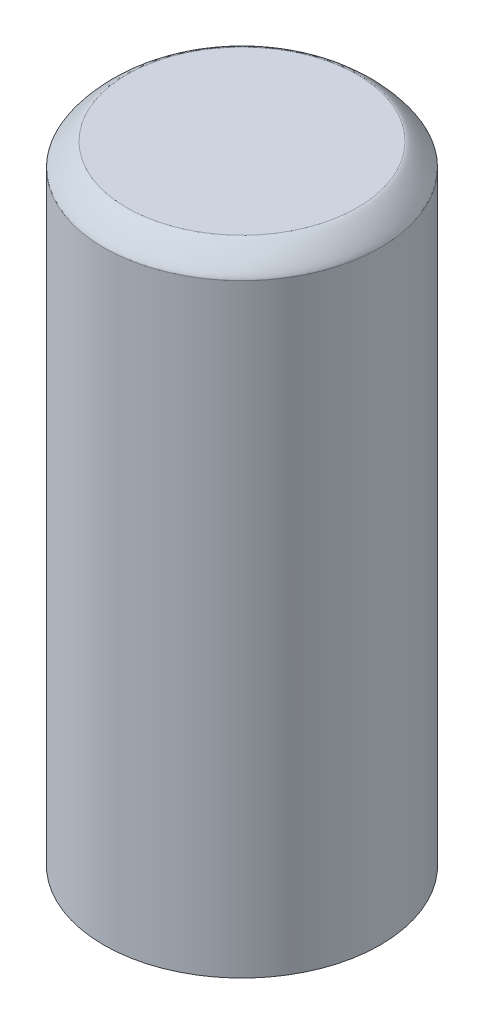
ISO-10303-21;
HEADER;
FILE_DESCRIPTION(('STEP AP214'),'2;1');
FILE_NAME('part.step','',(''),(''),'','','');
FILE_SCHEMA(('AUTOMOTIVE_DESIGN { 1 0 10303 214 1 1 1 1 }'));
ENDSEC;
DATA;
#1=APPLICATION_CONTEXT('core data for automotive mechanical design processes');
#2=APPLICATION_PROTOCOL_DEFINITION('international standard','automotive_design',2000,#1);
#3=PRODUCT_CONTEXT('',#1,'mechanical');
#4=PRODUCT('Part','Part','',(#3));
#5=PRODUCT_RELATED_PRODUCT_CATEGORY('part','',(#4));
#6=PRODUCT_DEFINITION_FORMATION('','',#4);
#7=PRODUCT_DEFINITION_CONTEXT('part definition',#1,'design');
#8=PRODUCT_DEFINITION('design','',#6,#7);
#9=PRODUCT_DEFINITION_SHAPE('','',#8);
#10=(LENGTH_UNIT() NAMED_UNIT(*) SI_UNIT(.MILLI.,.METRE.));
#11=(NAMED_UNIT(*) PLANE_ANGLE_UNIT() SI_UNIT($,.RADIAN.));
#12=(NAMED_UNIT(*) SI_UNIT($,.STERADIAN.) SOLID_ANGLE_UNIT());
#13=UNCERTAINTY_MEASURE_WITH_UNIT(LENGTH_MEASURE(1.E-05),#10,'distance_accuracy_value','');
#14=(GEOMETRIC_REPRESENTATION_CONTEXT(3) GLOBAL_UNCERTAINTY_ASSIGNED_CONTEXT((#13)) GLOBAL_UNIT_ASSIGNED_CONTEXT((#10,
#11,#12)) REPRESENTATION_CONTEXT('',''));
#15=CARTESIAN_POINT('',(0.,0.,0.));
#16=DIRECTION('',(0.,0.,1.));
#17=DIRECTION('',(1.,0.,0.));
#18=AXIS2_PLACEMENT_3D('',#15,#16,#17);
#19=CARTESIAN_POINT('',(0.,13.6,0.));
#20=DIRECTION('',(0.,-1.,0.));
#21=DIRECTION('',(0.,0.,-1.));
#22=AXIS2_PLACEMENT_3D('',#19,#20,#21);
#23=CYLINDRICAL_SURFACE('',#22,3.);
#24=CARTESIAN_POINT('',(0.,13.1,3.));
#25=CARTESIAN_POINT('',(0.392699071226847,13.1,3.));
#26=CARTESIAN_POINT('',(0.78524366275268,13.1,2.9219180259975));
#27=CARTESIAN_POINT('',(1.51085693143786,13.1,2.62135916907022));
#28=CARTESIAN_POINT('',(1.84364016732954,13.1,2.39900051978975));
#29=CARTESIAN_POINT('',(2.39900051978975,13.1,1.84364016732954));
#30=CARTESIAN_POINT('',(2.62135916907022,13.1,1.51085693143788));
#31=CARTESIAN_POINT('',(2.92191802599751,13.1,0.785243662752659));
#32=CARTESIAN_POINT('',(3.,13.1,0.392699071226749));
#33=CARTESIAN_POINT('',(3.,13.1,-0.392699071226749));
#34=CARTESIAN_POINT('',(2.92191802599749,13.1,-0.785243662752691));
#35=CARTESIAN_POINT('',(2.62135916907023,13.1,-1.51085693143785));
#36=CARTESIAN_POINT('',(2.39900051978978,13.1,-1.84364016732951));
#37=CARTESIAN_POINT('',(1.8436401673295,13.1,-2.39900051978978));
#38=CARTESIAN_POINT('',(1.51085693143785,13.1,-2.62135916907023));
#39=CARTESIAN_POINT('',(0.785243662752694,13.1,-2.92191802599749));
#40=CARTESIAN_POINT('',(0.392699071226749,13.1,-3.));
#41=CARTESIAN_POINT('',(-0.392699071226748,13.1,-3.));
#42=CARTESIAN_POINT('',(-0.785243662752686,13.1,-2.9219180259975));
#43=CARTESIAN_POINT('',(-1.51085693143785,13.1,-2.62135916907023));
#44=CARTESIAN_POINT('',(-1.84364016732954,13.1,-2.39900051978974));
#45=CARTESIAN_POINT('',(-2.39900051978975,13.1,-1.84364016732954));
#46=CARTESIAN_POINT('',(-2.62135916907021,13.1,-1.51085693143788));
#47=CARTESIAN_POINT('',(-2.92191802599751,13.1,-0.785243662752664));
#48=CARTESIAN_POINT('',(-3.,13.1,-0.392699071226745));
#49=CARTESIAN_POINT('',(-3.,13.1,0.392699071226754));
#50=CARTESIAN_POINT('',(-2.9219180259975,13.1,0.785243662752685));
#51=CARTESIAN_POINT('',(-2.62135916907023,13.1,1.51085693143784));
#52=CARTESIAN_POINT('',(-2.39900051978975,13.1,1.84364016732953));
#53=CARTESIAN_POINT('',(-1.84364016732955,13.1,2.39900051978974));
#54=CARTESIAN_POINT('',(-1.51085693143785,13.1,2.62135916907023));
#55=CARTESIAN_POINT('',(-0.785243662752694,13.1,2.92191802599749));
#56=CARTESIAN_POINT('',(-0.392699071226848,13.1,3.));
#57=CARTESIAN_POINT('',(0.,13.1,3.));
#58=(BOUNDED_CURVE() B_SPLINE_CURVE(3,(#24,#25,#26,#27,#28,#29,#30,#31,#32,#33,#34,#35,#36,#37,
#38,#39,#40,#41,#42,#43,#44,#45,#46,#47,#48,#49,#50,#51,#52,#53,#54,#55,#56,#57),.UNSPECIFIED.,
.T.,.F.) B_SPLINE_CURVE_WITH_KNOTS((4,2,2,2,2,2,2,2,2,2,2,2,2,2,2,2,4),(0.,0.392699081698724,
0.785398163397448,1.17809724509617,1.5707963267949,1.96349540849362,2.35619449019234,
2.74889357189107,3.14159265358979,3.53429173528852,3.92699081698724,4.31968989868597,
4.71238898038469,5.10508806208341,5.49778714378214,5.89048622548086,6.28318530717959),
.UNSPECIFIED.) CURVE() GEOMETRIC_REPRESENTATION_ITEM() RATIONAL_B_SPLINE_CURVE((0.999999999999963,
0.999999999999963,0.999999999999963,0.999999999999963,0.999999999999963,0.999999999999963,
0.999999999999963,0.999999999999963,0.999999999999963,0.999999999999963,0.999999999999963,
0.999999999999963,0.999999999999963,0.999999999999963,0.999999999999963,0.999999999999963,
0.999999999999963,0.999999999999963,0.999999999999963,0.999999999999963,0.999999999999963,
0.999999999999963,0.999999999999963,0.999999999999963,0.999999999999963,0.999999999999963,
0.999999999999963,0.999999999999963,0.999999999999963,0.999999999999963,0.999999999999963,
0.999999999999963,0.999999999999963,0.999999999999963)) REPRESENTATION_ITEM(''));
#59=CARTESIAN_POINT('',(0.,13.1,3.));
#60=VERTEX_POINT('',#59);
#61=EDGE_CURVE('E11',#60,#60,#58,.F.);
#62=ORIENTED_EDGE('',*,*,#61,.T.);
#63=EDGE_LOOP('',(#62));
#64=FACE_BOUND('',#63,.T.);
#65=CARTESIAN_POINT('',(0.,0.,0.));
#66=DIRECTION('',(0.,1.,0.));
#67=DIRECTION('',(0.,0.,1.));
#68=AXIS2_PLACEMENT_3D('',#65,#66,#67);
#69=CIRCLE('',#68,3.);
#70=CARTESIAN_POINT('',(0.,0.,3.));
#71=VERTEX_POINT('',#70);
#72=EDGE_CURVE('E51',#71,#71,#69,.T.);
#73=ORIENTED_EDGE('',*,*,#72,.T.);
#74=EDGE_LOOP('',(#73));
#75=FACE_BOUND('',#74,.T.);
#76=ADVANCED_FACE('F34',(#64,#75),#23,.T.);
#77=CARTESIAN_POINT('',(0.,13.6,0.));
#78=DIRECTION('',(0.,1.,0.));
#79=DIRECTION('',(0.,0.,1.));
#80=AXIS2_PLACEMENT_3D('',#77,#78,#79);
#81=PLANE('',#80);
#82=CARTESIAN_POINT('',(0.,13.6,2.5));
#83=CARTESIAN_POINT('',(-0.0409052481509312,13.6,2.50000006617747));
#84=CARTESIAN_POINT('',(-0.0818096781630555,13.6,2.49898335698272));
#85=CARTESIAN_POINT('',(-0.163518212495015,13.6,2.49493567681808));
#86=CARTESIAN_POINT('',(-0.204322318424316,13.6,2.49190473837622));
#87=CARTESIAN_POINT('',(-0.285733577358172,13.6,2.4838478147328));
#88=CARTESIAN_POINT('',(-0.326340726794507,13.6,2.47882179352238));
#89=CARTESIAN_POINT('',(-0.407262017777786,13.6,2.46679390634881));
#90=CARTESIAN_POINT('',(-0.447576154134936,13.6,2.45979200547631));
#91=CARTESIAN_POINT('',(-0.527815199830451,13.6,2.44383146859168));
#92=CARTESIAN_POINT('',(-0.567740109168817,13.6,2.43487283257957));
#93=CARTESIAN_POINT('',(-0.6471045213121,13.6,2.41501790448334));
#94=CARTESIAN_POINT('',(-0.686544032680984,13.6,2.40412164663759));
#95=CARTESIAN_POINT('',(-0.764841421042821,13.6,2.38041056826906));
#96=CARTESIAN_POINT('',(-0.803699308521022,13.6,2.36759578237855));
#97=CARTESIAN_POINT('',(-0.88073735135589,13.6,2.34006671921941));
#98=CARTESIAN_POINT('',(-0.918917495757736,13.6,2.32535241127925));
#99=CARTESIAN_POINT('',(-0.994499666067721,13.6,2.29404525127718));
#100=CARTESIAN_POINT('',(-1.03190169197586,13.6,2.27745239921526));
#101=CARTESIAN_POINT('',(-1.10584180176352,13.6,2.24244426388046));
#102=CARTESIAN_POINT('',(-1.14237989958485,13.6,2.22402901004185));
#103=CARTESIAN_POINT('',(-1.21451077793755,13.6,2.18543066036773));
#104=CARTESIAN_POINT('',(-1.2501035413944,13.6,2.16524753262934));
#105=CARTESIAN_POINT('',(-1.32026221049554,13.6,2.12316797186274));
#106=CARTESIAN_POINT('',(-1.35482809798532,13.6,2.10127150856868));
#107=CARTESIAN_POINT('',(-1.4228514722141,13.6,2.05581974302993));
#108=CARTESIAN_POINT('',(-1.4563089589531,13.6,2.03226444078523));
#109=CARTESIAN_POINT('',(-1.52203396418431,13.6,1.98354943312055));
#110=CARTESIAN_POINT('',(-1.55430150369108,13.6,1.9583897560554));
#111=CARTESIAN_POINT('',(-1.61756502105077,13.6,1.90652046282195));
#112=CARTESIAN_POINT('',(-1.648561021844,13.6,1.87981087463717));
#113=CARTESIAN_POINT('',(-1.70919997655589,13.6,1.82489615395677));
#114=CARTESIAN_POINT('',(-1.73884290861615,13.6,1.79669099731658));
#115=CARTESIAN_POINT('',(-1.79669099731659,13.6,1.73884290861614));
#116=CARTESIAN_POINT('',(-1.82489615395678,13.6,1.70919997655589));
#117=CARTESIAN_POINT('',(-1.87981087463718,13.6,1.64856102184399));
#118=CARTESIAN_POINT('',(-1.90652046282196,13.6,1.61756502105076));
#119=CARTESIAN_POINT('',(-1.95838975605541,13.6,1.55430150369107));
#120=CARTESIAN_POINT('',(-1.98354943312056,13.6,1.52203396418431));
#121=CARTESIAN_POINT('',(-2.03226444078523,13.6,1.45630895895308));
#122=CARTESIAN_POINT('',(-2.05581974302992,13.6,1.42285147221402));
#123=CARTESIAN_POINT('',(-2.1012715085687,13.6,1.35482809798537));
#124=CARTESIAN_POINT('',(-2.12316797186278,13.6,1.32026221049577));
#125=CARTESIAN_POINT('',(-2.16524753262931,13.6,1.25010354139415));
#126=CARTESIAN_POINT('',(-2.18543066036761,13.6,1.21451077793664));
#127=CARTESIAN_POINT('',(-2.22402901004198,13.6,1.14237989958574));
#128=CARTESIAN_POINT('',(-2.24244426388093,13.6,1.10584180176687));
#129=CARTESIAN_POINT('',(-2.27745239921479,13.6,1.03190169197249));
#130=CARTESIAN_POINT('',(-2.29404525127542,13.6,0.994499666055162));
#131=CARTESIAN_POINT('',(-2.32535241128101,13.6,0.918917495770279));
#132=CARTESIAN_POINT('',(-2.34006671922597,13.6,0.880737351402722));
#133=CARTESIAN_POINT('',(-2.36759578237199,13.6,0.803699308474169));
#134=CARTESIAN_POINT('',(-2.38041056824457,13.6,0.764841420867995));
#135=CARTESIAN_POINT('',(-2.40412164666209,13.6,0.686544032855779));
#136=CARTESIAN_POINT('',(-2.41501790457475,13.6,0.6471045219645));
#137=CARTESIAN_POINT('',(-2.43487283248817,13.6,0.567740108516354));
#138=CARTESIAN_POINT('',(-2.44383146825055,13.6,0.52781519739548));
#139=CARTESIAN_POINT('',(-2.45979200581745,13.6,0.447576156569843));
#140=CARTESIAN_POINT('',(-2.46679390762197,13.6,0.40726202686508));
#141=CARTESIAN_POINT('',(-2.47882179224925,13.6,0.326340717707305));
#142=CARTESIAN_POINT('',(-2.48384780998145,13.6,0.285733543444643));
#143=CARTESIAN_POINT('',(-2.49190474312748,13.6,0.204322352337171));
#144=CARTESIAN_POINT('',(-2.49493569454987,13.6,0.16351833905846));
#145=CARTESIAN_POINT('',(-2.49898333925064,13.6,0.0818095515975307));
#146=CARTESIAN_POINT('',(-2.5,13.6,0.0409047757987673));
#147=CARTESIAN_POINT('',(-2.5,13.6,-0.0409047757987597));
#148=CARTESIAN_POINT('',(-2.49898333925064,13.6,-0.0818095515975234));
#149=CARTESIAN_POINT('',(-2.49493569454987,13.6,-0.163518339058453));
#150=CARTESIAN_POINT('',(-2.49190474312748,13.6,-0.204322352337164));
#151=CARTESIAN_POINT('',(-2.48384780998145,13.6,-0.285733543444639));
#152=CARTESIAN_POINT('',(-2.47882179224925,13.6,-0.326340717707301));
#153=CARTESIAN_POINT('',(-2.46679390762197,13.6,-0.407262026865078));
#154=CARTESIAN_POINT('',(-2.45979200581745,13.6,-0.447576156569842));
#155=CARTESIAN_POINT('',(-2.44383146825054,13.6,-0.527815197395481));
#156=CARTESIAN_POINT('',(-2.43487283248817,13.6,-0.567740108516356));
#157=CARTESIAN_POINT('',(-2.41501790457475,13.6,-0.647104521964503));
#158=CARTESIAN_POINT('',(-2.40412164666208,13.6,-0.686544032855783));
#159=CARTESIAN_POINT('',(-2.38041056824457,13.6,-0.764841420868));
#160=CARTESIAN_POINT('',(-2.36759578237199,13.6,-0.803699308474175));
#161=CARTESIAN_POINT('',(-2.34006671922597,13.6,-0.880737351402729));
#162=CARTESIAN_POINT('',(-2.32535241128101,13.6,-0.918917495770286));
#163=CARTESIAN_POINT('',(-2.29404525127542,13.6,-0.994499666055169));
#164=CARTESIAN_POINT('',(-2.27745239921478,13.6,-1.0319016919725));
#165=CARTESIAN_POINT('',(-2.24244426388093,13.6,-1.10584180176688));
#166=CARTESIAN_POINT('',(-2.22402901004197,13.6,-1.14237989958575));
#167=CARTESIAN_POINT('',(-2.18543066036761,13.6,-1.21451077793665));
#168=CARTESIAN_POINT('',(-2.16524753262931,13.6,-1.25010354139416));
#169=CARTESIAN_POINT('',(-2.12316797186278,13.6,-1.32026221049579));
#170=CARTESIAN_POINT('',(-2.1012715085687,13.6,-1.35482809798539));
#171=CARTESIAN_POINT('',(-2.05581974302992,13.6,-1.42285147221404));
#172=CARTESIAN_POINT('',(-2.03226444078523,13.6,-1.4563089589531));
#173=CARTESIAN_POINT('',(-1.98354943312055,13.6,-1.52203396418433));
#174=CARTESIAN_POINT('',(-1.95838975605541,13.6,-1.55430150369109));
#175=CARTESIAN_POINT('',(-1.90652046282196,13.6,-1.61756502105078));
#176=CARTESIAN_POINT('',(-1.87981087463718,13.6,-1.648561021844));
#177=CARTESIAN_POINT('',(-1.82489615395677,13.6,-1.7091999765559));
#178=CARTESIAN_POINT('',(-1.79669099731659,13.6,-1.73884290861615));
#179=CARTESIAN_POINT('',(-1.73884290861615,13.6,-1.79669099731658));
#180=CARTESIAN_POINT('',(-1.70919997655589,13.6,-1.82489615395676));
#181=CARTESIAN_POINT('',(-1.64856102184399,13.6,-1.87981087463717));
#182=CARTESIAN_POINT('',(-1.61756502105076,13.6,-1.90652046282194));
#183=CARTESIAN_POINT('',(-1.55430150369107,13.6,-1.95838975605539));
#184=CARTESIAN_POINT('',(-1.52203396418432,13.6,-1.98354943312054));
#185=CARTESIAN_POINT('',(-1.45630895895308,13.6,-2.03226444078521));
#186=CARTESIAN_POINT('',(-1.42285147221403,13.6,-2.05581974302991));
#187=CARTESIAN_POINT('',(-1.35482809798538,13.6,-2.10127150856868));
#188=CARTESIAN_POINT('',(-1.32026221049578,13.6,-2.12316797186277));
#189=CARTESIAN_POINT('',(-1.25010354139415,13.6,-2.1652475326293));
#190=CARTESIAN_POINT('',(-1.21451077793664,13.6,-2.1854306603676));
#191=CARTESIAN_POINT('',(-1.14237989958574,13.6,-2.22402901004197));
#192=CARTESIAN_POINT('',(-1.10584180176687,13.6,-2.24244426388093));
#193=CARTESIAN_POINT('',(-1.03190169197249,13.6,-2.27745239921479));
#194=CARTESIAN_POINT('',(-0.994499666055162,13.6,-2.29404525127542));
#195=CARTESIAN_POINT('',(-0.91891749577028,13.6,-2.32535241128101));
#196=CARTESIAN_POINT('',(-0.880737351402724,13.6,-2.34006671922597));
#197=CARTESIAN_POINT('',(-0.80369930847417,13.6,-2.36759578237199));
#198=CARTESIAN_POINT('',(-0.764841420867996,13.6,-2.38041056824457));
#199=CARTESIAN_POINT('',(-0.686544032855779,13.6,-2.40412164666209));
#200=CARTESIAN_POINT('',(-0.6471045219645,13.6,-2.41501790457475));
#201=CARTESIAN_POINT('',(-0.567740108516353,13.6,-2.43487283248817));
#202=CARTESIAN_POINT('',(-0.527815197395479,13.6,-2.44383146825055));
#203=CARTESIAN_POINT('',(-0.447576156569841,13.6,-2.45979200581745));
#204=CARTESIAN_POINT('',(-0.407262026865077,13.6,-2.46679390762197));
#205=CARTESIAN_POINT('',(-0.326340717707302,13.6,-2.47882179224925));
#206=CARTESIAN_POINT('',(-0.285733543444641,13.6,-2.48384780998145));
#207=CARTESIAN_POINT('',(-0.204322352337168,13.6,-2.49190474312748));
#208=CARTESIAN_POINT('',(-0.163518339058456,13.6,-2.49493569454987));
#209=CARTESIAN_POINT('',(-0.0818095515975266,13.6,-2.49898333925064));
#210=CARTESIAN_POINT('',(-0.0409047757987632,13.6,-2.5));
#211=CARTESIAN_POINT('',(0.0409047757987639,13.6,-2.5));
#212=CARTESIAN_POINT('',(0.0818095515975275,13.6,-2.49898333925064));
#213=CARTESIAN_POINT('',(0.163518339058458,13.6,-2.49493569454987));
#214=CARTESIAN_POINT('',(0.204322352337169,13.6,-2.49190474312748));
#215=CARTESIAN_POINT('',(0.285733543444643,13.6,-2.48384780998145));
#216=CARTESIAN_POINT('',(0.326340717707304,13.6,-2.47882179224925));
#217=CARTESIAN_POINT('',(0.40726202686508,13.6,-2.46679390762197));
#218=CARTESIAN_POINT('',(0.447576156569844,13.6,-2.45979200581744));
#219=CARTESIAN_POINT('',(0.527815197395483,13.6,-2.44383146825054));
#220=CARTESIAN_POINT('',(0.567740108516358,13.6,-2.43487283248816));
#221=CARTESIAN_POINT('',(0.647104521964505,13.6,-2.41501790457475));
#222=CARTESIAN_POINT('',(0.686544032855785,13.6,-2.40412164666208));
#223=CARTESIAN_POINT('',(0.764841420868002,13.6,-2.38041056824457));
#224=CARTESIAN_POINT('',(0.803699308474177,13.6,-2.36759578237199));
#225=CARTESIAN_POINT('',(0.88073735140273,13.6,-2.34006671922597));
#226=CARTESIAN_POINT('',(0.918917495770287,13.6,-2.32535241128101));
#227=CARTESIAN_POINT('',(0.994499666055168,13.6,-2.29404525127542));
#228=CARTESIAN_POINT('',(1.03190169197249,13.6,-2.27745239921479));
#229=CARTESIAN_POINT('',(1.10584180176688,13.6,-2.24244426388093));
#230=CARTESIAN_POINT('',(1.14237989958574,13.6,-2.22402901004197));
#231=CARTESIAN_POINT('',(1.21451077793664,13.6,-2.18543066036761));
#232=CARTESIAN_POINT('',(1.25010354139415,13.6,-2.16524753262931));
#233=CARTESIAN_POINT('',(1.32026221049577,13.6,-2.12316797186278));
#234=CARTESIAN_POINT('',(1.35482809798537,13.6,-2.1012715085687));
#235=CARTESIAN_POINT('',(1.42285147221402,13.6,-2.05581974302992));
#236=CARTESIAN_POINT('',(1.45630895895307,13.6,-2.03226444078523));
#237=CARTESIAN_POINT('',(1.5220339641843,13.6,-1.98354943312055));
#238=CARTESIAN_POINT('',(1.55430150369106,13.6,-1.95838975605541));
#239=CARTESIAN_POINT('',(1.61756502105075,13.6,-1.90652046282196));
#240=CARTESIAN_POINT('',(1.64856102184398,13.6,-1.87981087463718));
#241=CARTESIAN_POINT('',(1.70919997655588,13.6,-1.82489615395677));
#242=CARTESIAN_POINT('',(1.73884290861614,13.6,-1.79669099731659));
#243=CARTESIAN_POINT('',(1.79669099731659,13.6,-1.73884290861615));
#244=CARTESIAN_POINT('',(1.82489615395678,13.6,-1.70919997655589));
#245=CARTESIAN_POINT('',(1.87981087463719,13.6,-1.64856102184399));
#246=CARTESIAN_POINT('',(1.90652046282197,13.6,-1.61756502105076));
#247=CARTESIAN_POINT('',(1.95838975605542,13.6,-1.55430150369107));
#248=CARTESIAN_POINT('',(1.98354943312057,13.6,-1.52203396418432));
#249=CARTESIAN_POINT('',(2.03226444078524,13.6,-1.45630895895308));
#250=CARTESIAN_POINT('',(2.05581974302993,13.6,-1.42285147221402));
#251=CARTESIAN_POINT('',(2.10127150856871,13.6,-1.35482809798537));
#252=CARTESIAN_POINT('',(2.12316797186279,13.6,-1.32026221049577));
#253=CARTESIAN_POINT('',(2.16524753262931,13.6,-1.25010354139414));
#254=CARTESIAN_POINT('',(2.18543066036762,13.6,-1.21451077793664));
#255=CARTESIAN_POINT('',(2.22402901004198,13.6,-1.14237989958574));
#256=CARTESIAN_POINT('',(2.24244426388093,13.6,-1.10584180176687));
#257=CARTESIAN_POINT('',(2.27745239921479,13.6,-1.03190169197249));
#258=CARTESIAN_POINT('',(2.29404525127542,13.6,-0.994499666055165));
#259=CARTESIAN_POINT('',(2.32535241128101,13.6,-0.918917495770286));
#260=CARTESIAN_POINT('',(2.34006671922597,13.6,-0.880737351402731));
#261=CARTESIAN_POINT('',(2.36759578237199,13.6,-0.80369930847418));
#262=CARTESIAN_POINT('',(2.38041056824457,13.6,-0.764841420868006));
#263=CARTESIAN_POINT('',(2.40412164666208,13.6,-0.68654403285579));
#264=CARTESIAN_POINT('',(2.41501790457475,13.6,-0.647104521964511));
#265=CARTESIAN_POINT('',(2.43487283248817,13.6,-0.567740108516363));
#266=CARTESIAN_POINT('',(2.44383146825055,13.6,-0.527815197395488));
#267=CARTESIAN_POINT('',(2.45979200581745,13.6,-0.447576156569849));
#268=CARTESIAN_POINT('',(2.46679390762197,13.6,-0.407262026865084));
#269=CARTESIAN_POINT('',(2.47882179224925,13.6,-0.326340717707307));
#270=CARTESIAN_POINT('',(2.48384780998145,13.6,-0.285733543444645));
#271=CARTESIAN_POINT('',(2.49190474312748,13.6,-0.20432235233717));
#272=CARTESIAN_POINT('',(2.49493569454987,13.6,-0.163518339058459));
#273=CARTESIAN_POINT('',(2.49898333925064,13.6,-0.0818095515975278));
#274=CARTESIAN_POINT('',(2.5,13.6,-0.0409047757987638));
#275=CARTESIAN_POINT('',(2.5,13.6,0.0409047757987639));
#276=CARTESIAN_POINT('',(2.49898333925064,13.6,0.0818095515975275));
#277=CARTESIAN_POINT('',(2.49493569454987,13.6,0.163518339058457));
#278=CARTESIAN_POINT('',(2.49190474312748,13.6,0.204322352337169));
#279=CARTESIAN_POINT('',(2.48384780998145,13.6,0.285733543444642));
#280=CARTESIAN_POINT('',(2.47882179224925,13.6,0.326340717707303));
#281=CARTESIAN_POINT('',(2.46679390762197,13.6,0.407262026865078));
#282=CARTESIAN_POINT('',(2.45979200581745,13.6,0.447576156569842));
#283=CARTESIAN_POINT('',(2.44383146825055,13.6,0.52781519739548));
#284=CARTESIAN_POINT('',(2.43487283248817,13.6,0.567740108516355));
#285=CARTESIAN_POINT('',(2.41501790457475,13.6,0.647104521964502));
#286=CARTESIAN_POINT('',(2.40412164666209,13.6,0.686544032855781));
#287=CARTESIAN_POINT('',(2.38041056824457,13.6,0.764841420867998));
#288=CARTESIAN_POINT('',(2.36759578237199,13.6,0.803699308474173));
#289=CARTESIAN_POINT('',(2.34006671922597,13.6,0.880737351402726));
#290=CARTESIAN_POINT('',(2.32535241128101,13.6,0.918917495770282));
#291=CARTESIAN_POINT('',(2.29404525127542,13.6,0.994499666055165));
#292=CARTESIAN_POINT('',(2.27745239921479,13.6,1.03190169197249));
#293=CARTESIAN_POINT('',(2.24244426388093,13.6,1.10584180176688));
#294=CARTESIAN_POINT('',(2.22402901004197,13.6,1.14237989958574));
#295=CARTESIAN_POINT('',(2.18543066036761,13.6,1.21451077793665));
#296=CARTESIAN_POINT('',(2.16524753262931,13.6,1.25010354139415));
#297=CARTESIAN_POINT('',(2.12316797186278,13.6,1.32026221049578));
#298=CARTESIAN_POINT('',(2.1012715085687,13.6,1.35482809798538));
#299=CARTESIAN_POINT('',(2.05581974302992,13.6,1.42285147221403));
#300=CARTESIAN_POINT('',(2.03226444078523,13.6,1.45630895895308));
#301=CARTESIAN_POINT('',(1.98354943312055,13.6,1.52203396418432));
#302=CARTESIAN_POINT('',(1.95838975605541,13.6,1.55430150369107));
#303=CARTESIAN_POINT('',(1.90652046282196,13.6,1.61756502105076));
#304=CARTESIAN_POINT('',(1.87981087463718,13.6,1.64856102184399));
#305=CARTESIAN_POINT('',(1.82489615395677,13.6,1.70919997655589));
#306=CARTESIAN_POINT('',(1.79669099731659,13.6,1.73884290861615));
#307=CARTESIAN_POINT('',(1.73884290861615,13.6,1.79669099731659));
#308=CARTESIAN_POINT('',(1.70919997655589,13.6,1.82489615395677));
#309=CARTESIAN_POINT('',(1.64856102184399,13.6,1.87981087463718));
#310=CARTESIAN_POINT('',(1.61756502105077,13.6,1.90652046282196));
#311=CARTESIAN_POINT('',(1.55430150369107,13.6,1.95838975605541));
#312=CARTESIAN_POINT('',(1.5220339641843,13.6,1.98354943312055));
#313=CARTESIAN_POINT('',(1.4563089589531,13.6,2.03226444078524));
#314=CARTESIAN_POINT('',(1.42285147221409,13.6,2.05581974302994));
#315=CARTESIAN_POINT('',(1.35482809798531,13.6,2.10127150856869));
#316=CARTESIAN_POINT('',(1.32026221049553,13.6,2.12316797186275));
#317=CARTESIAN_POINT('',(1.25010354139439,13.6,2.16524753262935));
#318=CARTESIAN_POINT('',(1.21451077793754,13.6,2.18543066036774));
#319=CARTESIAN_POINT('',(1.14237989958484,13.6,2.22402901004185));
#320=CARTESIAN_POINT('',(1.10584180176351,13.6,2.24244426388046));
#321=CARTESIAN_POINT('',(1.03190169197585,13.6,2.27745239921526));
#322=CARTESIAN_POINT('',(0.994499666067716,13.6,2.29404525127718));
#323=CARTESIAN_POINT('',(0.918917495757734,13.6,2.32535241127925));
#324=CARTESIAN_POINT('',(0.880737351355888,13.6,2.3400667192194));
#325=CARTESIAN_POINT('',(0.803699308521023,13.6,2.36759578237855));
#326=CARTESIAN_POINT('',(0.764841421042822,13.6,2.38041056826906));
#327=CARTESIAN_POINT('',(0.686544032680985,13.6,2.40412164663759));
#328=CARTESIAN_POINT('',(0.6471045213121,13.6,2.41501790448333));
#329=CARTESIAN_POINT('',(0.567740109168817,13.6,2.43487283257957));
#330=CARTESIAN_POINT('',(0.527815199830452,13.6,2.44383146859168));
#331=CARTESIAN_POINT('',(0.447576154134936,13.6,2.4597920054763));
#332=CARTESIAN_POINT('',(0.407262017777786,13.6,2.46679390634881));
#333=CARTESIAN_POINT('',(0.326340726794508,13.6,2.47882179352238));
#334=CARTESIAN_POINT('',(0.285733577358173,13.6,2.4838478147328));
#335=CARTESIAN_POINT('',(0.204322318424317,13.6,2.49190473837622));
#336=CARTESIAN_POINT('',(0.163518212495016,13.6,2.49493567681808));
#337=CARTESIAN_POINT('',(0.0818096781630558,13.6,2.49898335698272));
#338=CARTESIAN_POINT('',(0.0409052481509313,13.6,2.50000006617747));
#339=CARTESIAN_POINT('',(0.,13.6,2.5));
#340=B_SPLINE_CURVE_WITH_KNOTS('',3,(#82,#83,#84,#85,#86,#87,#88,#89,#90,#91,#92,#93,#94,#95,
#96,#97,#98,#99,#100,#101,#102,#103,#104,#105,#106,#107,#108,#109,#110,#111,#112,#113,#114,#115,
#116,#117,#118,#119,#120,#121,#122,#123,#124,#125,#126,#127,#128,#129,#130,#131,#132,#133,#134,
#135,#136,#137,#138,#139,#140,#141,#142,#143,#144,#145,#146,#147,#148,#149,#150,#151,#152,#153,
#154,#155,#156,#157,#158,#159,#160,#161,#162,#163,#164,#165,#166,#167,#168,#169,#170,#171,#172,
#173,#174,#175,#176,#177,#178,#179,#180,#181,#182,#183,#184,#185,#186,#187,#188,#189,#190,#191,
#192,#193,#194,#195,#196,#197,#198,#199,#200,#201,#202,#203,#204,#205,#206,#207,#208,#209,#210,
#211,#212,#213,#214,#215,#216,#217,#218,#219,#220,#221,#222,#223,#224,#225,#226,#227,#228,#229,
#230,#231,#232,#233,#234,#235,#236,#237,#238,#239,#240,#241,#242,#243,#244,#245,#246,#247,#248,
#249,#250,#251,#252,#253,#254,#255,#256,#257,#258,#259,#260,#261,#262,#263,#264,#265,#266,#267,
#268,#269,#270,#271,#272,#273,#274,#275,#276,#277,#278,#279,#280,#281,#282,#283,#284,#285,#286,
#287,#288,#289,#290,#291,#292,#293,#294,#295,#296,#297,#298,#299,#300,#301,#302,#303,#304,#305,
#306,#307,#308,#309,#310,#311,#312,#313,#314,#315,#316,#317,#318,#319,#320,#321,#322,#323,#324,
#325,#326,#327,#328,#329,#330,#331,#332,#333,#334,#335,#336,#337,#338,#339),.UNSPECIFIED.,.F.,
.F.,(4,2,2,2,2,2,2,2,2,2,2,2,2,2,2,2,2,2,2,2,2,2,2,2,2,2,2,2,2,2,2,2,2,2,2,2,2,2,2,2,2,2,2,2,2,
2,2,2,2,2,2,2,2,2,2,2,2,2,2,2,2,2,2,2,2,2,2,2,2,2,2,2,2,2,2,2,2,2,2,2,2,2,2,2,2,2,2,2,2,2,2,2,2,
2,2,2,2,2,2,2,2,2,2,2,2,2,2,2,2,2,2,2,2,2,2,2,2,2,2,2,2,2,2,2,2,2,2,2,4),(0.,0.12270195209587,
0.245401922711705,0.368104108016641,0.490808461329764,0.613512814642883,0.736214999947807,
0.858914970563624,0.981616922659472,1.10431887475532,1.22701884537115,1.34972103067608,
1.47242538398921,1.59512973730234,1.71783192260727,1.8405318932231,1.96323384531894,
2.08593579741479,2.20863576803061,2.33133795333554,2.45404230664867,2.5767466599618,
2.69944884526673,2.82214881588256,2.94485076797841,3.06755272007425,3.19025269069008,
3.31295487599501,3.43565922930814,3.55836358262126,3.6810657679262,3.80376573854202,
3.92646769063786,4.04916964273371,4.17186961334953,4.29457179865447,4.4172761519676,
4.53998050528073,4.66268269058566,4.78538266120149,4.90808461329734,5.03078656539319,
5.15348653600902,5.27618872131395,5.39889307462708,5.52159742794021,5.64429961324514,
5.76699958386096,5.8897015359568,6.01240348805264,6.13510345866846,6.25780564397339,
6.38050999728652,6.50321435059965,6.62591653590459,6.74861650652042,6.87131845861627,
6.99402041071212,7.11672038132794,7.23942256663288,7.362126919946,7.48483127325913,
7.60753345856406,7.73023342917989,7.85293538127573,7.97563733337158,8.0983373039874,
8.22103948929234,8.34374384260547,8.46644819591859,8.58915038122353,8.71185035183935,
8.8345523039352,8.95725425603105,9.07995422664687,9.2026564119518,9.32536076526492,
9.44806511857805,9.57076730388298,9.69346727449881,9.81616922659466,9.93887117869051,
10.0615711493063,10.1842733346113,10.3069776879244,10.4296820412375,10.5523842265425,
10.6750841971583,10.7977861492541,10.92048810135,11.0431880719658,11.1658902572707,
11.2885946105839,11.411298963897,11.5340011492019,11.6567011198178,11.7794030719136,
11.9021050240094,12.0248049946253,12.1475071799302,12.2702115332433,12.3929158865565,
12.5156180718614,12.6383180424772,12.7610199945731,12.8837219466689,13.0064219172847,
13.1291241025897,13.2518284559028,13.3745328092159,13.4972349945209,13.6199349651367,
13.7426369172325,13.8653388693284,13.9880388399442,14.1107410252491,14.2334453785623,
14.3561497318754,14.4788519171803,14.6015518877962,14.724253839892,14.8469557919878,
14.9696557626037,15.0923579479086,15.2150623012217,15.3377666545348,15.4604688398398,
15.5831688104556,15.7058707625515),.UNSPECIFIED.);
#341=CARTESIAN_POINT('',(0.,13.6,2.5));
#342=VERTEX_POINT('',#341);
#343=EDGE_CURVE('E46',#342,#342,#340,.F.);
#344=ORIENTED_EDGE('',*,*,#343,.T.);
#345=EDGE_LOOP('',(#344));
#346=FACE_BOUND('',#345,.T.);
#347=ADVANCED_FACE('F64',(#346),#81,.T.);
#348=CARTESIAN_POINT('',(0.,0.,0.));
#349=DIRECTION('',(0.,1.,0.));
#350=DIRECTION('',(0.,0.,1.));
#351=AXIS2_PLACEMENT_3D('',#348,#349,#350);
#352=PLANE('',#351);
#353=ORIENTED_EDGE('',*,*,#72,.F.);
#354=EDGE_LOOP('',(#353));
#355=FACE_BOUND('',#354,.T.);
#356=ADVANCED_FACE('F73',(#355),#352,.F.);
#357=CARTESIAN_POINT('',(0.,13.6,2.5));
#358=CARTESIAN_POINT('',(0.327249226022373,13.6,2.5));
#359=CARTESIAN_POINT('',(0.654369718960572,13.6,2.43493168833123));
#360=CARTESIAN_POINT('',(1.25904744286488,13.6,2.1844659742252));
#361=CARTESIAN_POINT('',(1.53636680610796,13.6,1.99916709982478));
#362=CARTESIAN_POINT('',(1.99916709982478,13.6,1.53636680610796));
#363=CARTESIAN_POINT('',(2.18446597422518,13.6,1.25904744286488));
#364=CARTESIAN_POINT('',(2.43493168833125,13.6,0.654369718960565));
#365=CARTESIAN_POINT('',(2.5,13.6,0.327249226022291));
#366=CARTESIAN_POINT('',(2.5,13.6,-0.327249226022291));
#367=CARTESIAN_POINT('',(2.43493168833125,13.6,-0.654369718960584));
#368=CARTESIAN_POINT('',(2.18446597422518,13.6,-1.25904744286487));
#369=CARTESIAN_POINT('',(1.99916709982481,13.6,-1.53636680610796));
#370=CARTESIAN_POINT('',(1.53636680610793,13.6,-1.99916709982478));
#371=CARTESIAN_POINT('',(1.25904744286489,13.6,-2.18446597422518));
#372=CARTESIAN_POINT('',(0.654369718960569,13.6,-2.43493168833125));
#373=CARTESIAN_POINT('',(0.327249226022291,13.6,-2.5));
#374=CARTESIAN_POINT('',(-0.32724922602229,13.6,-2.5));
#375=CARTESIAN_POINT('',(-0.654369718960562,13.6,-2.43493168833125));
#376=CARTESIAN_POINT('',(-1.25904744286488,13.6,-2.18446597422518));
#377=CARTESIAN_POINT('',(-1.53636680610796,13.6,-1.99916709982474));
#378=CARTESIAN_POINT('',(-1.99916709982478,13.6,-1.536366806108));
#379=CARTESIAN_POINT('',(-2.18446597422518,13.6,-1.25904744286489));
#380=CARTESIAN_POINT('',(-2.43493168833125,13.6,-0.654369718960569));
#381=CARTESIAN_POINT('',(-2.5,13.6,-0.327249226022287));
#382=CARTESIAN_POINT('',(-2.5,13.6,0.327249226022295));
#383=CARTESIAN_POINT('',(-2.43493168833125,13.6,0.654369718960562));
#384=CARTESIAN_POINT('',(-2.18446597422519,13.6,1.25904744286488));
#385=CARTESIAN_POINT('',(-1.99916709982478,13.6,1.53636680610796));
#386=CARTESIAN_POINT('',(-1.53636680610797,13.6,1.99916709982477));
#387=CARTESIAN_POINT('',(-1.25904744286489,13.6,2.18446597422518));
#388=CARTESIAN_POINT('',(-0.654369718960569,13.6,2.43493168833125));
#389=CARTESIAN_POINT('',(-0.327249226022373,13.6,2.5));
#390=CARTESIAN_POINT('',(0.,13.6,2.5));
#391=CARTESIAN_POINT('',(0.,13.6,3.));
#392=CARTESIAN_POINT('',(0.392699071226847,13.6,2.99999999999993));
#393=CARTESIAN_POINT('',(0.785243662752672,13.6,2.92191802599748));
#394=CARTESIAN_POINT('',(1.51085693143787,13.6,2.62135916907024));
#395=CARTESIAN_POINT('',(1.84364016732961,13.6,2.39900051978967));
#396=CARTESIAN_POINT('',(2.39900051978967,13.6,1.84364016732961));
#397=CARTESIAN_POINT('',(2.62135916907022,13.6,1.51085693143792));
#398=CARTESIAN_POINT('',(2.9219180259975,13.6,0.785243662752621));
#399=CARTESIAN_POINT('',(3.,13.6,0.392699071226749));
#400=CARTESIAN_POINT('',(3.,13.6,-0.392699071226749));
#401=CARTESIAN_POINT('',(2.9219180259975,13.6,-0.785243662752694));
#402=CARTESIAN_POINT('',(2.62135916907022,13.6,-1.51085693143785));
#403=CARTESIAN_POINT('',(2.39900051978982,13.6,-1.84364016732954));
#404=CARTESIAN_POINT('',(1.84364016732947,13.6,-2.39900051978975));
#405=CARTESIAN_POINT('',(1.51085693143785,13.6,-2.62135916907022));
#406=CARTESIAN_POINT('',(0.785243662752697,13.6,-2.9219180259975));
#407=CARTESIAN_POINT('',(0.392699071226749,13.6,-3.));
#408=CARTESIAN_POINT('',(-0.392699071226748,13.6,-3.));
#409=CARTESIAN_POINT('',(-0.785243662752689,13.6,-2.9219180259975));
#410=CARTESIAN_POINT('',(-1.51085693143784,13.6,-2.62135916907022));
#411=CARTESIAN_POINT('',(-1.84364016732954,13.6,-2.39900051978974));
#412=CARTESIAN_POINT('',(-2.39900051978975,13.6,-1.84364016732954));
#413=CARTESIAN_POINT('',(-2.62135916907022,13.6,-1.51085693143785));
#414=CARTESIAN_POINT('',(-2.9219180259975,13.6,-0.785243662752697));
#415=CARTESIAN_POINT('',(-3.,13.6,-0.392699071226745));
#416=CARTESIAN_POINT('',(-3.,13.6,0.392699071226754));
#417=CARTESIAN_POINT('',(-2.9219180259975,13.6,0.785243662752724));
#418=CARTESIAN_POINT('',(-2.62135916907022,13.6,1.51085693143781));
#419=CARTESIAN_POINT('',(-2.39900051978975,13.6,1.84364016732953));
#420=CARTESIAN_POINT('',(-1.84364016732955,13.6,2.39900051978974));
#421=CARTESIAN_POINT('',(-1.51085693143785,13.6,2.62135916907022));
#422=CARTESIAN_POINT('',(-0.785243662752697,13.6,2.9219180259975));
#423=CARTESIAN_POINT('',(-0.392699071226848,13.6,3.00000000000007));
#424=CARTESIAN_POINT('',(0.,13.6,3.));
#425=CARTESIAN_POINT('',(0.,13.1,3.));
#426=CARTESIAN_POINT('',(0.392699071226847,13.1,3.));
#427=CARTESIAN_POINT('',(0.78524366275268,13.1,2.9219180259975));
#428=CARTESIAN_POINT('',(1.51085693143786,13.1,2.62135916907022));
#429=CARTESIAN_POINT('',(1.84364016732954,13.1,2.39900051978975));
#430=CARTESIAN_POINT('',(2.39900051978975,13.1,1.84364016732954));
#431=CARTESIAN_POINT('',(2.62135916907022,13.1,1.51085693143788));
#432=CARTESIAN_POINT('',(2.92191802599751,13.1,0.785243662752658));
#433=CARTESIAN_POINT('',(3.,13.1,0.392699071226749));
#434=CARTESIAN_POINT('',(3.,13.1,-0.392699071226749));
#435=CARTESIAN_POINT('',(2.92191802599749,13.1,-0.785243662752691));
#436=CARTESIAN_POINT('',(2.62135916907023,13.1,-1.51085693143785));
#437=CARTESIAN_POINT('',(2.39900051978978,13.1,-1.84364016732951));
#438=CARTESIAN_POINT('',(1.8436401673295,13.1,-2.39900051978978));
#439=CARTESIAN_POINT('',(1.51085693143785,13.1,-2.62135916907023));
#440=CARTESIAN_POINT('',(0.785243662752694,13.1,-2.92191802599749));
#441=CARTESIAN_POINT('',(0.392699071226749,13.1,-3.));
#442=CARTESIAN_POINT('',(-0.392699071226748,13.1,-3.));
#443=CARTESIAN_POINT('',(-0.785243662752686,13.1,-2.9219180259975));
#444=CARTESIAN_POINT('',(-1.51085693143785,13.1,-2.62135916907023));
#445=CARTESIAN_POINT('',(-1.84364016732954,13.1,-2.39900051978974));
#446=CARTESIAN_POINT('',(-2.39900051978975,13.1,-1.84364016732954));
#447=CARTESIAN_POINT('',(-2.62135916907021,13.1,-1.51085693143788));
#448=CARTESIAN_POINT('',(-2.92191802599751,13.1,-0.785243662752663));
#449=CARTESIAN_POINT('',(-3.,13.1,-0.392699071226745));
#450=CARTESIAN_POINT('',(-3.,13.1,0.392699071226754));
#451=CARTESIAN_POINT('',(-2.9219180259975,13.1,0.785243662752685));
#452=CARTESIAN_POINT('',(-2.62135916907023,13.1,1.51085693143784));
#453=CARTESIAN_POINT('',(-2.39900051978975,13.1,1.84364016732953));
#454=CARTESIAN_POINT('',(-1.84364016732955,13.1,2.39900051978974));
#455=CARTESIAN_POINT('',(-1.51085693143785,13.1,2.62135916907023));
#456=CARTESIAN_POINT('',(-0.785243662752694,13.1,2.92191802599749));
#457=CARTESIAN_POINT('',(-0.392699071226848,13.1,3.));
#458=CARTESIAN_POINT('',(0.,13.1,3.));
#459=(BOUNDED_SURFACE() B_SPLINE_SURFACE(2,3,((#357,#358,#359,#360,#361,#362,#363,#364,#365,
#366,#367,#368,#369,#370,#371,#372,#373,#374,#375,#376,#377,#378,#379,#380,#381,#382,#383,#384,
#385,#386,#387,#388,#389,#390),(#391,#392,#393,#394,#395,#396,#397,#398,#399,#400,#401,#402,
#403,#404,#405,#406,#407,#408,#409,#410,#411,#412,#413,#414,#415,#416,#417,#418,#419,#420,#421,
#422,#423,#424),(#425,#426,#427,#428,#429,#430,#431,#432,#433,#434,#435,#436,#437,#438,#439,
#440,#441,#442,#443,#444,#445,#446,#447,#448,#449,#450,#451,#452,#453,#454,#455,#456,#457,
#458)),.UNSPECIFIED.,.F.,.T.,.F.) B_SPLINE_SURFACE_WITH_KNOTS((3,3),(4,2,2,2,2,2,2,2,2,2,2,2,2,
2,2,2,4),(0.,1.),(0.,0.392699081698724,0.785398163397448,1.17809724509617,1.5707963267949,
1.96349540849362,2.35619449019234,2.74889357189107,3.14159265358979,3.53429173528852,
3.92699081698724,4.31968989868597,4.71238898038469,5.10508806208341,5.49778714378214,
5.89048622548086,6.28318530717959),
.UNSPECIFIED.) GEOMETRIC_REPRESENTATION_ITEM() RATIONAL_B_SPLINE_SURFACE(((1.,1.,1.,1.,1.,1.,1.,
1.,1.,1.,1.,1.,1.,1.,1.,1.,1.,1.,1.,1.,1.,1.,1.,1.,1.,1.,1.,1.,1.,1.,1.,1.,1.,1.),
(0.176776695296637,0.176776695296637,0.176776695296637,0.176776695296637,0.176776695296637,
0.176776695296637,0.176776695296637,0.176776695296637,0.176776695296637,0.176776695296637,
0.176776695296637,0.176776695296637,0.176776695296637,0.176776695296637,0.176776695296637,
0.176776695296637,0.176776695296637,0.176776695296637,0.176776695296637,0.176776695296637,
0.176776695296637,0.176776695296637,0.176776695296637,0.176776695296637,0.176776695296637,
0.176776695296637,0.176776695296637,0.176776695296637,0.176776695296637,0.176776695296637,
0.176776695296637,0.176776695296637,0.176776695296637,0.176776695296637),(1.,1.,1.,1.,1.,1.,1.,
1.,1.,1.,1.,1.,1.,1.,1.,1.,1.,1.,1.,1.,1.,1.,1.,1.,1.,1.,1.,1.,1.,1.,1.,1.,1.,1.))) REPRESENTATION_ITEM('') SURFACE());
#460=ORIENTED_EDGE('',*,*,#61,.F.);
#461=EDGE_LOOP('',(#460));
#462=FACE_BOUND('',#461,.T.);
#463=ORIENTED_EDGE('',*,*,#343,.F.);
#464=EDGE_LOOP('',(#463));
#465=FACE_BOUND('',#464,.T.);
#466=ADVANCED_FACE('F36',(#462,#465),#459,.T.);
#467=CLOSED_SHELL('',(#76,#347,#356,#466));
#468=MANIFOLD_SOLID_BREP('B2',#467);
#469=ADVANCED_BREP_SHAPE_REPRESENTATION('',(#18,#468),#14);
#470=SHAPE_DEFINITION_REPRESENTATION(#9,#469);
ENDSEC;
END-ISO-10303-21;
